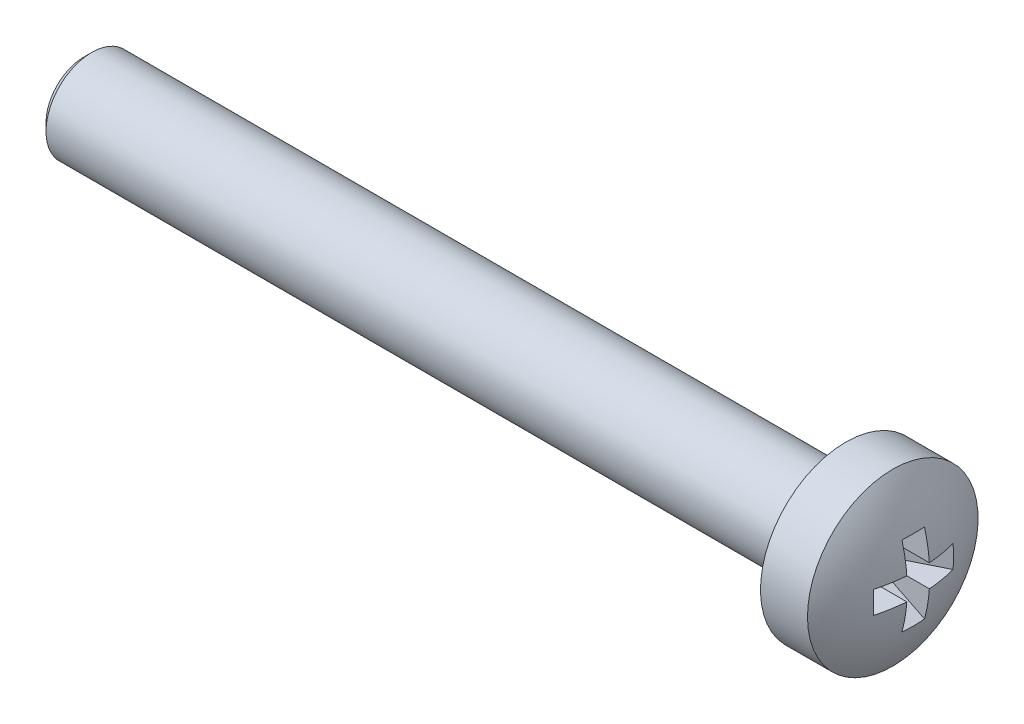
ISO-10303-21;
HEADER;
FILE_DESCRIPTION(('STEP AP214'),'2;1');
FILE_NAME('part.step','',(''),(''),'','','');
FILE_SCHEMA(('AUTOMOTIVE_DESIGN { 1 0 10303 214 1 1 1 1 }'));
ENDSEC;
DATA;
#1=APPLICATION_CONTEXT('core data for automotive mechanical design processes');
#2=APPLICATION_PROTOCOL_DEFINITION('international standard','automotive_design',2000,#1);
#3=PRODUCT_CONTEXT('',#1,'mechanical');
#4=PRODUCT('Part','Part','',(#3));
#5=PRODUCT_RELATED_PRODUCT_CATEGORY('part','',(#4));
#6=PRODUCT_DEFINITION_FORMATION('','',#4);
#7=PRODUCT_DEFINITION_CONTEXT('part definition',#1,'design');
#8=PRODUCT_DEFINITION('design','',#6,#7);
#9=PRODUCT_DEFINITION_SHAPE('','',#8);
#10=(LENGTH_UNIT() NAMED_UNIT(*) SI_UNIT(.MILLI.,.METRE.));
#11=(NAMED_UNIT(*) PLANE_ANGLE_UNIT() SI_UNIT($,.RADIAN.));
#12=(NAMED_UNIT(*) SI_UNIT($,.STERADIAN.) SOLID_ANGLE_UNIT());
#13=UNCERTAINTY_MEASURE_WITH_UNIT(LENGTH_MEASURE(1.E-05),#10,'distance_accuracy_value','');
#14=(GEOMETRIC_REPRESENTATION_CONTEXT(3) GLOBAL_UNCERTAINTY_ASSIGNED_CONTEXT((#13)) GLOBAL_UNIT_ASSIGNED_CONTEXT((#10,
#11,#12)) REPRESENTATION_CONTEXT('',''));
#15=CARTESIAN_POINT('',(0.,0.,0.));
#16=DIRECTION('',(0.,0.,1.));
#17=DIRECTION('',(1.,0.,0.));
#18=AXIS2_PLACEMENT_3D('',#15,#16,#17);
#19=CARTESIAN_POINT('',(-5.,0.,0.));
#20=DIRECTION('',(1.,0.,0.));
#21=DIRECTION('',(0.,-1.,0.));
#22=AXIS2_PLACEMENT_3D('',#19,#20,#21);
#23=SPHERICAL_SURFACE('',#22,5.);
#24=CARTESIAN_POINT('',(-4.56358241491322,0.,-0.875318258911803));
#25=DIRECTION('',(0.446197813109809,0.,-0.894934361602025));
#26=DIRECTION('',(-0.894934361602025,0.,-0.446197813109809));
#27=AXIS2_PLACEMENT_3D('',#24,#25,#26);
#28=CIRCLE('',#27,4.90340265907692);
#29=CARTESIAN_POINT('',(-0.187869730483241,0.37,1.3063316076711));
#30=VERTEX_POINT('',#29);
#31=CARTESIAN_POINT('',(-0.187869730483241,-0.37,1.3063316076711));
#32=VERTEX_POINT('',#31);
#33=EDGE_CURVE('E195',#30,#32,#28,.T.);
#34=ORIENTED_EDGE('',*,*,#33,.F.);
#35=CARTESIAN_POINT('',(-5.,0.37,0.));
#36=DIRECTION('',(0.,-1.,0.));
#37=DIRECTION('',(0.,0.,-1.));
#38=AXIS2_PLACEMENT_3D('',#35,#36,#37);
#39=CIRCLE('',#38,4.98629120689917);
#40=CARTESIAN_POINT('',(-0.0274553797879303,0.37,0.37));
#41=VERTEX_POINT('',#40);
#42=EDGE_CURVE('E114',#30,#41,#39,.F.);
#43=ORIENTED_EDGE('',*,*,#42,.T.);
#44=CARTESIAN_POINT('',(-5.,0.,0.37));
#45=DIRECTION('',(0.,0.,1.));
#46=DIRECTION('',(0.,-1.,0.));
#47=AXIS2_PLACEMENT_3D('',#44,#45,#46);
#48=CIRCLE('',#47,4.98629120689917);
#49=CARTESIAN_POINT('',(-0.187869730483241,1.3063316076711,0.37));
#50=VERTEX_POINT('',#49);
#51=EDGE_CURVE('E146',#50,#41,#48,.F.);
#52=ORIENTED_EDGE('',*,*,#51,.F.);
#53=CARTESIAN_POINT('',(-4.56358241491322,-0.875318258911803,0.));
#54=DIRECTION('',(0.446197813109809,-0.894934361602025,0.));
#55=DIRECTION('',(0.894934361602025,0.446197813109809,0.));
#56=AXIS2_PLACEMENT_3D('',#53,#54,#55);
#57=CIRCLE('',#56,4.90340265907692);
#58=CARTESIAN_POINT('',(-0.187869730483241,1.3063316076711,-0.37));
#59=VERTEX_POINT('',#58);
#60=EDGE_CURVE('E143',#50,#59,#57,.F.);
#61=ORIENTED_EDGE('',*,*,#60,.T.);
#62=CARTESIAN_POINT('',(-5.,0.,-0.37));
#63=DIRECTION('',(0.,0.,1.));
#64=DIRECTION('',(0.,-1.,0.));
#65=AXIS2_PLACEMENT_3D('',#62,#63,#64);
#66=CIRCLE('',#65,4.98629120689917);
#67=CARTESIAN_POINT('',(-0.0274553797879303,0.37,-0.37));
#68=VERTEX_POINT('',#67);
#69=EDGE_CURVE('E147',#59,#68,#66,.F.);
#70=ORIENTED_EDGE('',*,*,#69,.T.);
#71=CARTESIAN_POINT('',(-5.,0.37,0.));
#72=DIRECTION('',(0.,-1.,0.));
#73=DIRECTION('',(0.,0.,-1.));
#74=AXIS2_PLACEMENT_3D('',#71,#72,#73);
#75=CIRCLE('',#74,4.98629120689917);
#76=CARTESIAN_POINT('',(-0.187869730483241,0.37,-1.3063316076711));
#77=VERTEX_POINT('',#76);
#78=EDGE_CURVE('E197',#68,#77,#75,.F.);
#79=ORIENTED_EDGE('',*,*,#78,.T.);
#80=CARTESIAN_POINT('',(-4.56358241491322,0.,0.875318258911803));
#81=DIRECTION('',(0.446197813109809,0.,0.894934361602025));
#82=DIRECTION('',(0.894934361602025,0.,-0.446197813109809));
#83=AXIS2_PLACEMENT_3D('',#80,#81,#82);
#84=CIRCLE('',#83,4.90340265907692);
#85=CARTESIAN_POINT('',(-0.187869730483241,-0.37,-1.3063316076711));
#86=VERTEX_POINT('',#85);
#87=EDGE_CURVE('E200',#77,#86,#84,.F.);
#88=ORIENTED_EDGE('',*,*,#87,.T.);
#89=CARTESIAN_POINT('',(-5.,-0.37,0.));
#90=DIRECTION('',(0.,-1.,0.));
#91=DIRECTION('',(0.,0.,-1.));
#92=AXIS2_PLACEMENT_3D('',#89,#90,#91);
#93=CIRCLE('',#92,4.98629120689917);
#94=CARTESIAN_POINT('',(-0.0274553797879303,-0.37,-0.37));
#95=VERTEX_POINT('',#94);
#96=EDGE_CURVE('E201',#95,#86,#93,.F.);
#97=ORIENTED_EDGE('',*,*,#96,.F.);
#98=CARTESIAN_POINT('',(-5.,0.,-0.37));
#99=DIRECTION('',(0.,0.,1.));
#100=DIRECTION('',(0.,-1.,0.));
#101=AXIS2_PLACEMENT_3D('',#98,#99,#100);
#102=CIRCLE('',#101,4.98629120689917);
#103=CARTESIAN_POINT('',(-0.187869730483241,-1.3063316076711,-0.37));
#104=VERTEX_POINT('',#103);
#105=EDGE_CURVE('E157',#95,#104,#102,.F.);
#106=ORIENTED_EDGE('',*,*,#105,.T.);
#107=CARTESIAN_POINT('',(-4.56358241491322,0.875318258911802,0.));
#108=DIRECTION('',(0.446197813109809,0.894934361602025,0.));
#109=DIRECTION('',(-0.894934361602025,0.446197813109809,0.));
#110=AXIS2_PLACEMENT_3D('',#107,#108,#109);
#111=CIRCLE('',#110,4.90340265907692);
#112=CARTESIAN_POINT('',(-0.187869730483241,-1.3063316076711,0.37));
#113=VERTEX_POINT('',#112);
#114=EDGE_CURVE('E154',#113,#104,#111,.T.);
#115=ORIENTED_EDGE('',*,*,#114,.F.);
#116=CARTESIAN_POINT('',(-5.,0.,0.37));
#117=DIRECTION('',(0.,0.,1.));
#118=DIRECTION('',(0.,-1.,0.));
#119=AXIS2_PLACEMENT_3D('',#116,#117,#118);
#120=CIRCLE('',#119,4.98629120689917);
#121=CARTESIAN_POINT('',(-0.0274553797879303,-0.37,0.37));
#122=VERTEX_POINT('',#121);
#123=EDGE_CURVE('E158',#122,#113,#120,.F.);
#124=ORIENTED_EDGE('',*,*,#123,.F.);
#125=CARTESIAN_POINT('',(-5.,-0.37,0.));
#126=DIRECTION('',(0.,-1.,0.));
#127=DIRECTION('',(0.,0.,-1.));
#128=AXIS2_PLACEMENT_3D('',#125,#126,#127);
#129=CIRCLE('',#128,4.98629120689917);
#130=EDGE_CURVE('E193',#32,#122,#129,.F.);
#131=ORIENTED_EDGE('',*,*,#130,.F.);
#132=EDGE_LOOP('',(#34,#43,#52,#61,#70,#79,#88,#97,#106,#115,#124,#131));
#133=FACE_BOUND('',#132,.T.);
#134=CARTESIAN_POINT('',(-0.857536964558404,0.,0.));
#135=DIRECTION('',(1.,0.,0.));
#136=DIRECTION('',(0.,1.,0.));
#137=AXIS2_PLACEMENT_3D('',#134,#135,#136);
#138=CIRCLE('',#137,2.8);
#139=CARTESIAN_POINT('',(-0.857536964558404,2.8,0.));
#140=VERTEX_POINT('',#139);
#141=EDGE_CURVE('E118',#140,#140,#138,.T.);
#142=ORIENTED_EDGE('',*,*,#141,.T.);
#143=EDGE_LOOP('',(#142));
#144=FACE_BOUND('',#143,.T.);
#145=ADVANCED_FACE('F16',(#133,#144),#23,.T.);
#146=CARTESIAN_POINT('',(-27.4,0.,0.));
#147=DIRECTION('',(-1.,0.,0.));
#148=DIRECTION('',(0.,-1.,0.));
#149=AXIS2_PLACEMENT_3D('',#146,#147,#148);
#150=PLANE('',#149);
#151=CARTESIAN_POINT('',(-27.4,0.,0.));
#152=DIRECTION('',(-1.,0.,0.));
#153=DIRECTION('',(0.,-1.,0.));
#154=AXIS2_PLACEMENT_3D('',#151,#152,#153);
#155=CIRCLE('',#154,1.25);
#156=CARTESIAN_POINT('',(-27.4,-1.25,0.));
#157=VERTEX_POINT('',#156);
#158=EDGE_CURVE('E10',#157,#157,#155,.T.);
#159=ORIENTED_EDGE('',*,*,#158,.T.);
#160=EDGE_LOOP('',(#159));
#161=FACE_BOUND('',#160,.T.);
#162=ADVANCED_FACE('F262',(#161),#150,.T.);
#163=CARTESIAN_POINT('',(0.,0.,0.));
#164=DIRECTION('',(1.,0.,0.));
#165=DIRECTION('',(0.,1.,0.));
#166=AXIS2_PLACEMENT_3D('',#163,#164,#165);
#167=CYLINDRICAL_SURFACE('',#166,1.5);
#168=CARTESIAN_POINT('',(-27.15,0.,0.));
#169=DIRECTION('',(-1.,0.,0.));
#170=DIRECTION('',(0.,-1.,0.));
#171=AXIS2_PLACEMENT_3D('',#168,#169,#170);
#172=CIRCLE('',#171,1.5);
#173=CARTESIAN_POINT('',(-27.15,-1.5,0.));
#174=VERTEX_POINT('',#173);
#175=EDGE_CURVE('E26',#174,#174,#172,.F.);
#176=ORIENTED_EDGE('',*,*,#175,.T.);
#177=EDGE_LOOP('',(#176));
#178=FACE_BOUND('',#177,.T.);
#179=CARTESIAN_POINT('',(-2.4,0.,0.));
#180=DIRECTION('',(1.,0.,0.));
#181=DIRECTION('',(0.,1.,0.));
#182=AXIS2_PLACEMENT_3D('',#179,#180,#181);
#183=CIRCLE('',#182,1.5);
#184=CARTESIAN_POINT('',(-2.4,1.5,0.));
#185=VERTEX_POINT('',#184);
#186=EDGE_CURVE('E190',#185,#185,#183,.T.);
#187=ORIENTED_EDGE('',*,*,#186,.F.);
#188=EDGE_LOOP('',(#187));
#189=FACE_BOUND('',#188,.T.);
#190=ADVANCED_FACE('F268',(#178,#189),#167,.T.);
#191=CARTESIAN_POINT('',(-2.4,1.5,0.));
#192=DIRECTION('',(-1.,0.,0.));
#193=DIRECTION('',(0.,-1.,0.));
#194=AXIS2_PLACEMENT_3D('',#191,#192,#193);
#195=PLANE('',#194);
#196=ORIENTED_EDGE('',*,*,#186,.T.);
#197=EDGE_LOOP('',(#196));
#198=FACE_BOUND('',#197,.T.);
#199=CARTESIAN_POINT('',(-2.4,0.,0.));
#200=DIRECTION('',(1.,0.,0.));
#201=DIRECTION('',(0.,1.,0.));
#202=AXIS2_PLACEMENT_3D('',#199,#200,#201);
#203=CIRCLE('',#202,2.8);
#204=CARTESIAN_POINT('',(-2.4,2.8,0.));
#205=VERTEX_POINT('',#204);
#206=EDGE_CURVE('E187',#205,#205,#203,.T.);
#207=ORIENTED_EDGE('',*,*,#206,.F.);
#208=EDGE_LOOP('',(#207));
#209=FACE_BOUND('',#208,.T.);
#210=ADVANCED_FACE('F299',(#198,#209),#195,.T.);
#211=CARTESIAN_POINT('',(0.,0.,0.));
#212=DIRECTION('',(1.,0.,0.));
#213=DIRECTION('',(0.,1.,0.));
#214=AXIS2_PLACEMENT_3D('',#211,#212,#213);
#215=CYLINDRICAL_SURFACE('',#214,2.8);
#216=ORIENTED_EDGE('',*,*,#206,.T.);
#217=EDGE_LOOP('',(#216));
#218=FACE_BOUND('',#217,.T.);
#219=ORIENTED_EDGE('',*,*,#141,.F.);
#220=EDGE_LOOP('',(#219));
#221=FACE_BOUND('',#220,.T.);
#222=ADVANCED_FACE('F296',(#218,#221),#215,.T.);
#223=CARTESIAN_POINT('',(0.,0.,1.4));
#224=DIRECTION('',(0.446197813109809,0.,-0.894934361602025));
#225=DIRECTION('',(-0.894934361602025,0.,-0.446197813109809));
#226=AXIS2_PLACEMENT_3D('',#223,#224,#225);
#227=PLANE('',#226);
#228=ORIENTED_EDGE('',*,*,#33,.T.);
#229=DIRECTION('',(-0.894934361602025,0.,-0.446197813109809));
#230=VECTOR('',#229,1.);
#231=CARTESIAN_POINT('',(0.,-0.37,1.4));
#232=LINE('',#231,#230);
#233=CARTESIAN_POINT('',(-1.75,-0.37,0.527482185906493));
#234=VERTEX_POINT('',#233);
#235=EDGE_CURVE('E35',#234,#32,#232,.F.);
#236=ORIENTED_EDGE('',*,*,#235,.F.);
#237=DIRECTION('',(0.,1.,0.));
#238=VECTOR('',#237,1.);
#239=CARTESIAN_POINT('',(-1.75,0.,0.527482185906493));
#240=LINE('',#239,#238);
#241=CARTESIAN_POINT('',(-1.75,0.37,0.527482185906493));
#242=VERTEX_POINT('',#241);
#243=EDGE_CURVE('E126',#242,#234,#240,.F.);
#244=ORIENTED_EDGE('',*,*,#243,.F.);
#245=DIRECTION('',(-0.894934361602025,0.,-0.446197813109809));
#246=VECTOR('',#245,1.);
#247=CARTESIAN_POINT('',(0.,0.37,1.4));
#248=LINE('',#247,#246);
#249=EDGE_CURVE('E107',#242,#30,#248,.F.);
#250=ORIENTED_EDGE('',*,*,#249,.T.);
#251=EDGE_LOOP('',(#228,#236,#244,#250));
#252=FACE_BOUND('',#251,.T.);
#253=ADVANCED_FACE('F18',(#252),#227,.T.);
#254=CARTESIAN_POINT('',(-1.75,0.37,0.));
#255=DIRECTION('',(0.,-1.,0.));
#256=DIRECTION('',(0.,0.,-1.));
#257=AXIS2_PLACEMENT_3D('',#254,#255,#256);
#258=PLANE('',#257);
#259=ORIENTED_EDGE('',*,*,#249,.F.);
#260=DIRECTION('',(0.,0.,-1.));
#261=VECTOR('',#260,1.);
#262=CARTESIAN_POINT('',(-1.75,0.37,0.));
#263=LINE('',#262,#261);
#264=CARTESIAN_POINT('',(-1.75,0.37,0.37));
#265=VERTEX_POINT('',#264);
#266=EDGE_CURVE('E111',#242,#265,#263,.T.);
#267=ORIENTED_EDGE('',*,*,#266,.T.);
#268=DIRECTION('',(1.,0.,0.));
#269=VECTOR('',#268,1.);
#270=CARTESIAN_POINT('',(-1.75,0.37,0.37));
#271=LINE('',#270,#269);
#272=EDGE_CURVE('E119',#265,#41,#271,.T.);
#273=ORIENTED_EDGE('',*,*,#272,.T.);
#274=ORIENTED_EDGE('',*,*,#42,.F.);
#275=EDGE_LOOP('',(#259,#267,#273,#274));
#276=FACE_BOUND('',#275,.T.);
#277=ADVANCED_FACE('F109',(#276),#258,.T.);
#278=CARTESIAN_POINT('',(-1.75,0.,0.37));
#279=DIRECTION('',(0.,0.,1.));
#280=DIRECTION('',(0.,-1.,0.));
#281=AXIS2_PLACEMENT_3D('',#278,#279,#280);
#282=PLANE('',#281);
#283=ORIENTED_EDGE('',*,*,#51,.T.);
#284=ORIENTED_EDGE('',*,*,#272,.F.);
#285=DIRECTION('',(0.,-1.,0.));
#286=VECTOR('',#285,1.);
#287=CARTESIAN_POINT('',(-1.75,0.,0.37));
#288=LINE('',#287,#286);
#289=CARTESIAN_POINT('',(-1.75,0.527482185906492,0.37));
#290=VERTEX_POINT('',#289);
#291=EDGE_CURVE('E129',#290,#265,#288,.T.);
#292=ORIENTED_EDGE('',*,*,#291,.F.);
#293=DIRECTION('',(0.894934361602025,0.446197813109809,0.));
#294=VECTOR('',#293,1.);
#295=CARTESIAN_POINT('',(-1.96063300229114,0.42246444491505,0.37));
#296=LINE('',#295,#294);
#297=EDGE_CURVE('E139',#290,#50,#296,.T.);
#298=ORIENTED_EDGE('',*,*,#297,.T.);
#299=EDGE_LOOP('',(#283,#284,#292,#298));
#300=FACE_BOUND('',#299,.T.);
#301=ADVANCED_FACE('F250',(#300),#282,.F.);
#302=CARTESIAN_POINT('',(0.,1.4,0.));
#303=DIRECTION('',(0.446197813109809,-0.894934361602025,0.));
#304=DIRECTION('',(0.894934361602025,0.446197813109809,0.));
#305=AXIS2_PLACEMENT_3D('',#302,#303,#304);
#306=PLANE('',#305);
#307=ORIENTED_EDGE('',*,*,#297,.F.);
#308=DIRECTION('',(0.,0.,-1.));
#309=VECTOR('',#308,1.);
#310=CARTESIAN_POINT('',(-1.75,0.527482185906492,0.));
#311=LINE('',#310,#309);
#312=CARTESIAN_POINT('',(-1.75,0.527482185906492,-0.37));
#313=VERTEX_POINT('',#312);
#314=EDGE_CURVE('E151',#290,#313,#311,.T.);
#315=ORIENTED_EDGE('',*,*,#314,.T.);
#316=DIRECTION('',(0.894934361602025,0.446197813109809,0.));
#317=VECTOR('',#316,1.);
#318=CARTESIAN_POINT('',(-1.96063300229114,0.42246444491505,-0.37));
#319=LINE('',#318,#317);
#320=EDGE_CURVE('E142',#313,#59,#319,.T.);
#321=ORIENTED_EDGE('',*,*,#320,.T.);
#322=ORIENTED_EDGE('',*,*,#60,.F.);
#323=EDGE_LOOP('',(#307,#315,#321,#322));
#324=FACE_BOUND('',#323,.T.);
#325=ADVANCED_FACE('F248',(#324),#306,.T.);
#326=CARTESIAN_POINT('',(-1.75,0.,-0.37));
#327=DIRECTION('',(0.,0.,1.));
#328=DIRECTION('',(0.,-1.,0.));
#329=AXIS2_PLACEMENT_3D('',#326,#327,#328);
#330=PLANE('',#329);
#331=ORIENTED_EDGE('',*,*,#320,.F.);
#332=DIRECTION('',(0.,-1.,0.));
#333=VECTOR('',#332,1.);
#334=CARTESIAN_POINT('',(-1.75,0.,-0.37));
#335=LINE('',#334,#333);
#336=CARTESIAN_POINT('',(-1.75,0.37,-0.37));
#337=VERTEX_POINT('',#336);
#338=EDGE_CURVE('E153',#313,#337,#335,.T.);
#339=ORIENTED_EDGE('',*,*,#338,.T.);
#340=DIRECTION('',(1.,0.,0.));
#341=VECTOR('',#340,1.);
#342=CARTESIAN_POINT('',(-1.75,0.37,-0.37));
#343=LINE('',#342,#341);
#344=EDGE_CURVE('E150',#337,#68,#343,.T.);
#345=ORIENTED_EDGE('',*,*,#344,.T.);
#346=ORIENTED_EDGE('',*,*,#69,.F.);
#347=EDGE_LOOP('',(#331,#339,#345,#346));
#348=FACE_BOUND('',#347,.T.);
#349=ADVANCED_FACE('F245',(#348),#330,.T.);
#350=CARTESIAN_POINT('',(-1.75,0.37,0.));
#351=DIRECTION('',(0.,-1.,0.));
#352=DIRECTION('',(0.,0.,-1.));
#353=AXIS2_PLACEMENT_3D('',#350,#351,#352);
#354=PLANE('',#353);
#355=ORIENTED_EDGE('',*,*,#344,.F.);
#356=DIRECTION('',(0.,0.,-1.));
#357=VECTOR('',#356,1.);
#358=CARTESIAN_POINT('',(-1.75,0.37,0.));
#359=LINE('',#358,#357);
#360=CARTESIAN_POINT('',(-1.75,0.37,-0.527482185906493));
#361=VERTEX_POINT('',#360);
#362=EDGE_CURVE('E173',#337,#361,#359,.T.);
#363=ORIENTED_EDGE('',*,*,#362,.T.);
#364=DIRECTION('',(0.894934361602025,0.,-0.446197813109809));
#365=VECTOR('',#364,1.);
#366=CARTESIAN_POINT('',(0.,0.37,-1.4));
#367=LINE('',#366,#365);
#368=EDGE_CURVE('E180',#361,#77,#367,.T.);
#369=ORIENTED_EDGE('',*,*,#368,.T.);
#370=ORIENTED_EDGE('',*,*,#78,.F.);
#371=EDGE_LOOP('',(#355,#363,#369,#370));
#372=FACE_BOUND('',#371,.T.);
#373=ADVANCED_FACE('F242',(#372),#354,.T.);
#374=CARTESIAN_POINT('',(0.,0.,-1.4));
#375=DIRECTION('',(0.446197813109809,0.,0.894934361602025));
#376=DIRECTION('',(0.894934361602025,0.,-0.446197813109809));
#377=AXIS2_PLACEMENT_3D('',#374,#375,#376);
#378=PLANE('',#377);
#379=ORIENTED_EDGE('',*,*,#368,.F.);
#380=DIRECTION('',(0.,-1.,0.));
#381=VECTOR('',#380,1.);
#382=CARTESIAN_POINT('',(-1.75,0.,-0.527482185906493));
#383=LINE('',#382,#381);
#384=CARTESIAN_POINT('',(-1.75,-0.37,-0.527482185906493));
#385=VERTEX_POINT('',#384);
#386=EDGE_CURVE('E172',#361,#385,#383,.T.);
#387=ORIENTED_EDGE('',*,*,#386,.T.);
#388=DIRECTION('',(0.894934361602025,0.,-0.446197813109809));
#389=VECTOR('',#388,1.);
#390=CARTESIAN_POINT('',(0.,-0.37,-1.4));
#391=LINE('',#390,#389);
#392=EDGE_CURVE('E182',#385,#86,#391,.T.);
#393=ORIENTED_EDGE('',*,*,#392,.T.);
#394=ORIENTED_EDGE('',*,*,#87,.F.);
#395=EDGE_LOOP('',(#379,#387,#393,#394));
#396=FACE_BOUND('',#395,.T.);
#397=ADVANCED_FACE('F236',(#396),#378,.T.);
#398=CARTESIAN_POINT('',(-1.75,-0.37,0.));
#399=DIRECTION('',(0.,-1.,0.));
#400=DIRECTION('',(0.,0.,-1.));
#401=AXIS2_PLACEMENT_3D('',#398,#399,#400);
#402=PLANE('',#401);
#403=ORIENTED_EDGE('',*,*,#96,.T.);
#404=ORIENTED_EDGE('',*,*,#392,.F.);
#405=DIRECTION('',(0.,0.,-1.));
#406=VECTOR('',#405,1.);
#407=CARTESIAN_POINT('',(-1.75,-0.37,0.));
#408=LINE('',#407,#406);
#409=CARTESIAN_POINT('',(-1.75,-0.37,-0.37));
#410=VERTEX_POINT('',#409);
#411=EDGE_CURVE('E165',#410,#385,#408,.T.);
#412=ORIENTED_EDGE('',*,*,#411,.F.);
#413=DIRECTION('',(1.,0.,0.));
#414=VECTOR('',#413,1.);
#415=CARTESIAN_POINT('',(-1.75,-0.37,-0.37));
#416=LINE('',#415,#414);
#417=EDGE_CURVE('E79',#410,#95,#416,.T.);
#418=ORIENTED_EDGE('',*,*,#417,.T.);
#419=EDGE_LOOP('',(#403,#404,#412,#418));
#420=FACE_BOUND('',#419,.T.);
#421=ADVANCED_FACE('F232',(#420),#402,.F.);
#422=CARTESIAN_POINT('',(-1.75,0.,-0.37));
#423=DIRECTION('',(0.,0.,1.));
#424=DIRECTION('',(0.,-1.,0.));
#425=AXIS2_PLACEMENT_3D('',#422,#423,#424);
#426=PLANE('',#425);
#427=ORIENTED_EDGE('',*,*,#417,.F.);
#428=DIRECTION('',(0.,-1.,0.));
#429=VECTOR('',#428,1.);
#430=CARTESIAN_POINT('',(-1.75,0.,-0.37));
#431=LINE('',#430,#429);
#432=CARTESIAN_POINT('',(-1.75,-0.527482185906493,-0.37));
#433=VERTEX_POINT('',#432);
#434=EDGE_CURVE('E73',#410,#433,#431,.T.);
#435=ORIENTED_EDGE('',*,*,#434,.T.);
#436=DIRECTION('',(-0.894934361602025,0.446197813109809,0.));
#437=VECTOR('',#436,1.);
#438=CARTESIAN_POINT('',(-1.96063300229114,-0.42246444491505,-0.37));
#439=LINE('',#438,#437);
#440=EDGE_CURVE('E20',#433,#104,#439,.F.);
#441=ORIENTED_EDGE('',*,*,#440,.T.);
#442=ORIENTED_EDGE('',*,*,#105,.F.);
#443=EDGE_LOOP('',(#427,#435,#441,#442));
#444=FACE_BOUND('',#443,.T.);
#445=ADVANCED_FACE('F228',(#444),#426,.T.);
#446=CARTESIAN_POINT('',(0.,-1.4,0.));
#447=DIRECTION('',(0.446197813109809,0.894934361602025,0.));
#448=DIRECTION('',(-0.894934361602025,0.446197813109809,0.));
#449=AXIS2_PLACEMENT_3D('',#446,#447,#448);
#450=PLANE('',#449);
#451=ORIENTED_EDGE('',*,*,#114,.T.);
#452=ORIENTED_EDGE('',*,*,#440,.F.);
#453=DIRECTION('',(0.,0.,1.));
#454=VECTOR('',#453,1.);
#455=CARTESIAN_POINT('',(-1.75,-0.527482185906493,0.));
#456=LINE('',#455,#454);
#457=CARTESIAN_POINT('',(-1.75,-0.527482185906493,0.37));
#458=VERTEX_POINT('',#457);
#459=EDGE_CURVE('E161',#458,#433,#456,.F.);
#460=ORIENTED_EDGE('',*,*,#459,.F.);
#461=DIRECTION('',(-0.894934361602025,0.446197813109809,0.));
#462=VECTOR('',#461,1.);
#463=CARTESIAN_POINT('',(-1.96063300229114,-0.42246444491505,0.37));
#464=LINE('',#463,#462);
#465=EDGE_CURVE('E159',#458,#113,#464,.F.);
#466=ORIENTED_EDGE('',*,*,#465,.T.);
#467=EDGE_LOOP('',(#451,#452,#460,#466));
#468=FACE_BOUND('',#467,.T.);
#469=ADVANCED_FACE('F227',(#468),#450,.T.);
#470=CARTESIAN_POINT('',(-1.75,0.,0.37));
#471=DIRECTION('',(0.,0.,1.));
#472=DIRECTION('',(0.,-1.,0.));
#473=AXIS2_PLACEMENT_3D('',#470,#471,#472);
#474=PLANE('',#473);
#475=ORIENTED_EDGE('',*,*,#123,.T.);
#476=ORIENTED_EDGE('',*,*,#465,.F.);
#477=DIRECTION('',(0.,-1.,0.));
#478=VECTOR('',#477,1.);
#479=CARTESIAN_POINT('',(-1.75,0.,0.37));
#480=LINE('',#479,#478);
#481=CARTESIAN_POINT('',(-1.75,-0.37,0.37));
#482=VERTEX_POINT('',#481);
#483=EDGE_CURVE('E133',#482,#458,#480,.T.);
#484=ORIENTED_EDGE('',*,*,#483,.F.);
#485=DIRECTION('',(1.,0.,0.));
#486=VECTOR('',#485,1.);
#487=CARTESIAN_POINT('',(-1.75,-0.37,0.37));
#488=LINE('',#487,#486);
#489=EDGE_CURVE('E138',#482,#122,#488,.T.);
#490=ORIENTED_EDGE('',*,*,#489,.T.);
#491=EDGE_LOOP('',(#475,#476,#484,#490));
#492=FACE_BOUND('',#491,.T.);
#493=ADVANCED_FACE('F225',(#492),#474,.F.);
#494=CARTESIAN_POINT('',(-1.75,-0.37,0.));
#495=DIRECTION('',(0.,-1.,0.));
#496=DIRECTION('',(0.,0.,-1.));
#497=AXIS2_PLACEMENT_3D('',#494,#495,#496);
#498=PLANE('',#497);
#499=ORIENTED_EDGE('',*,*,#130,.T.);
#500=ORIENTED_EDGE('',*,*,#489,.F.);
#501=DIRECTION('',(0.,0.,-1.));
#502=VECTOR('',#501,1.);
#503=CARTESIAN_POINT('',(-1.75,-0.37,0.));
#504=LINE('',#503,#502);
#505=EDGE_CURVE('E131',#234,#482,#504,.T.);
#506=ORIENTED_EDGE('',*,*,#505,.F.);
#507=ORIENTED_EDGE('',*,*,#235,.T.);
#508=EDGE_LOOP('',(#499,#500,#506,#507));
#509=FACE_BOUND('',#508,.T.);
#510=ADVANCED_FACE('F223',(#509),#498,.F.);
#511=CARTESIAN_POINT('',(-1.75,0.,0.));
#512=DIRECTION('',(1.,0.,0.));
#513=DIRECTION('',(0.,0.,-1.));
#514=AXIS2_PLACEMENT_3D('',#511,#512,#513);
#515=PLANE('',#514);
#516=ORIENTED_EDGE('',*,*,#243,.T.);
#517=ORIENTED_EDGE('',*,*,#505,.T.);
#518=ORIENTED_EDGE('',*,*,#483,.T.);
#519=ORIENTED_EDGE('',*,*,#459,.T.);
#520=ORIENTED_EDGE('',*,*,#434,.F.);
#521=ORIENTED_EDGE('',*,*,#411,.T.);
#522=ORIENTED_EDGE('',*,*,#386,.F.);
#523=ORIENTED_EDGE('',*,*,#362,.F.);
#524=ORIENTED_EDGE('',*,*,#338,.F.);
#525=ORIENTED_EDGE('',*,*,#314,.F.);
#526=ORIENTED_EDGE('',*,*,#291,.T.);
#527=ORIENTED_EDGE('',*,*,#266,.F.);
#528=EDGE_LOOP('',(#516,#517,#518,#519,#520,#521,#522,#523,#524,#525,#526,#527));
#529=FACE_BOUND('',#528,.T.);
#530=ADVANCED_FACE('F124',(#529),#515,.T.);
#531=CARTESIAN_POINT('',(-27.15,0.,0.));
#532=DIRECTION('',(1.,0.,0.));
#533=DIRECTION('',(0.,1.,0.));
#534=AXIS2_PLACEMENT_3D('',#531,#532,#533);
#535=CONICAL_SURFACE('',#534,1.5,0.785398163397445);
#536=ORIENTED_EDGE('',*,*,#158,.F.);
#537=EDGE_LOOP('',(#536));
#538=FACE_BOUND('',#537,.T.);
#539=ORIENTED_EDGE('',*,*,#175,.F.);
#540=EDGE_LOOP('',(#539));
#541=FACE_BOUND('',#540,.T.);
#542=ADVANCED_FACE('F273',(#538,#541),#535,.T.);
#543=CLOSED_SHELL('',(#145,#162,#190,#210,#222,#253,#277,#301,#325,#349,#373,#397,#421,#445,
#469,#493,#510,#530,#542));
#544=MANIFOLD_SOLID_BREP('B1',#543);
#545=ADVANCED_BREP_SHAPE_REPRESENTATION('',(#18,#544),#14);
#546=SHAPE_DEFINITION_REPRESENTATION(#9,#545);
ENDSEC;
END-ISO-10303-21;
